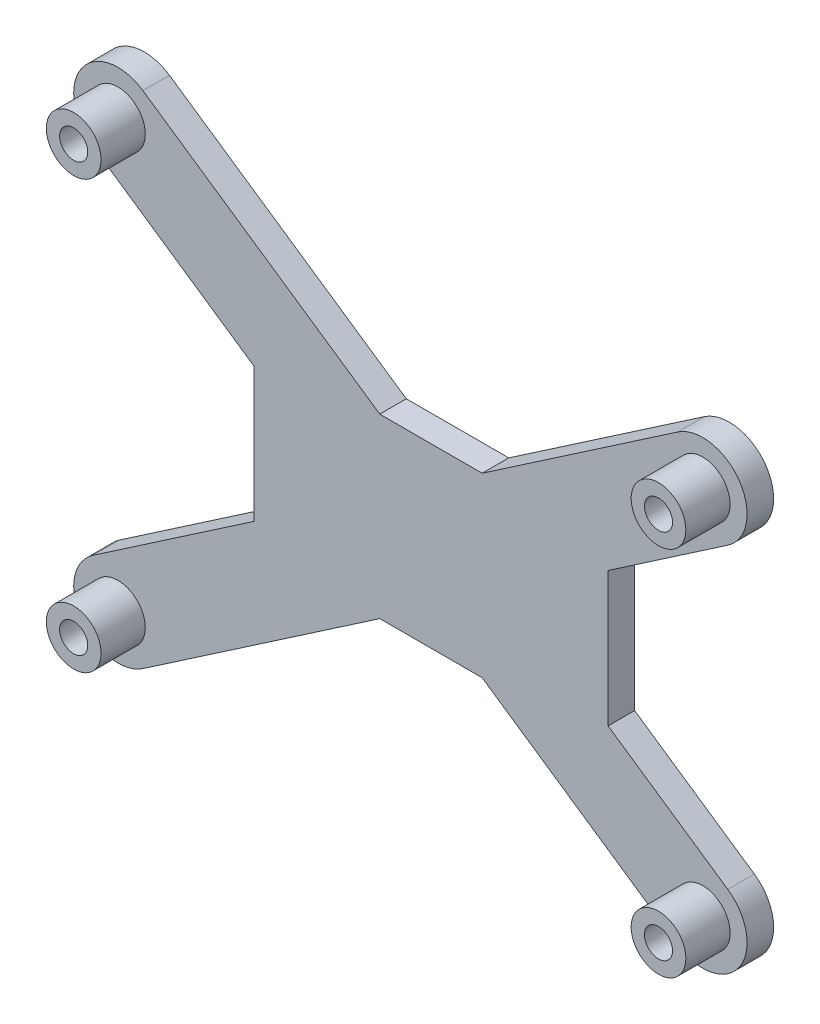
ISO-10303-21;
HEADER;
FILE_DESCRIPTION(('STEP AP214'),'2;1');
FILE_NAME('part.step','',(''),(''),'','','');
FILE_SCHEMA(('AUTOMOTIVE_DESIGN { 1 0 10303 214 1 1 1 1 }'));
ENDSEC;
DATA;
#1=APPLICATION_CONTEXT('core data for automotive mechanical design processes');
#2=APPLICATION_PROTOCOL_DEFINITION('international standard','automotive_design',2000,#1);
#3=PRODUCT_CONTEXT('',#1,'mechanical');
#4=PRODUCT('Part','Part','',(#3));
#5=PRODUCT_RELATED_PRODUCT_CATEGORY('part','',(#4));
#6=PRODUCT_DEFINITION_FORMATION('','',#4);
#7=PRODUCT_DEFINITION_CONTEXT('part definition',#1,'design');
#8=PRODUCT_DEFINITION('design','',#6,#7);
#9=PRODUCT_DEFINITION_SHAPE('','',#8);
#10=(LENGTH_UNIT() NAMED_UNIT(*) SI_UNIT(.MILLI.,.METRE.));
#11=(NAMED_UNIT(*) PLANE_ANGLE_UNIT() SI_UNIT($,.RADIAN.));
#12=(NAMED_UNIT(*) SI_UNIT($,.STERADIAN.) SOLID_ANGLE_UNIT());
#13=UNCERTAINTY_MEASURE_WITH_UNIT(LENGTH_MEASURE(1.E-05),#10,'distance_accuracy_value','');
#14=(GEOMETRIC_REPRESENTATION_CONTEXT(3) GLOBAL_UNCERTAINTY_ASSIGNED_CONTEXT((#13)) GLOBAL_UNIT_ASSIGNED_CONTEXT((#10,
#11,#12)) REPRESENTATION_CONTEXT('',''));
#15=CARTESIAN_POINT('',(0.,0.,0.));
#16=DIRECTION('',(0.,0.,1.));
#17=DIRECTION('',(1.,0.,0.));
#18=AXIS2_PLACEMENT_3D('',#15,#16,#17);
#19=CARTESIAN_POINT('',(14.605,51.435,0.));
#20=DIRECTION('',(0.,0.,1.));
#21=DIRECTION('',(1.,0.,0.));
#22=AXIS2_PLACEMENT_3D('',#19,#20,#21);
#23=PLANE('',#22);
#24=CARTESIAN_POINT('',(80.645,48.26,0.));
#25=DIRECTION('',(0.,0.,1.));
#26=DIRECTION('',(1.,0.,0.));
#27=AXIS2_PLACEMENT_3D('',#24,#25,#26);
#28=CIRCLE('',#27,3.08749999999998);
#29=CARTESIAN_POINT('',(83.7325,48.26,0.));
#30=VERTEX_POINT('',#29);
#31=EDGE_CURVE('E392',#30,#30,#28,.T.);
#32=ORIENTED_EDGE('',*,*,#31,.F.);
#33=EDGE_LOOP('',(#32));
#34=FACE_BOUND('',#33,.T.);
#35=CARTESIAN_POINT('',(14.605,3.175,0.));
#36=DIRECTION('',(0.,0.,1.));
#37=DIRECTION('',(1.,0.,0.));
#38=AXIS2_PLACEMENT_3D('',#35,#36,#37);
#39=CIRCLE('',#38,3.0875);
#40=CARTESIAN_POINT('',(17.6925,3.175,0.));
#41=VERTEX_POINT('',#40);
#42=EDGE_CURVE('E231',#41,#41,#39,.T.);
#43=ORIENTED_EDGE('',*,*,#42,.F.);
#44=EDGE_LOOP('',(#43));
#45=FACE_BOUND('',#44,.T.);
#46=CARTESIAN_POINT('',(14.605,51.435,0.));
#47=DIRECTION('',(0.,0.,1.));
#48=DIRECTION('',(1.,0.,0.));
#49=AXIS2_PLACEMENT_3D('',#46,#47,#48);
#50=CIRCLE('',#49,5.);
#51=CARTESIAN_POINT('',(17.4241477652776,55.5644558815334,0.));
#52=VERTEX_POINT('',#51);
#53=CARTESIAN_POINT('',(11.7858522347224,47.3055441184666,0.));
#54=VERTEX_POINT('',#53);
#55=EDGE_CURVE('E183',#52,#54,#50,.T.);
#56=ORIENTED_EDGE('',*,*,#55,.T.);
#57=DIRECTION('',(0.825891176306671,-0.563829553055516,0.));
#58=VECTOR('',#57,1.);
#59=CARTESIAN_POINT('',(11.7858522347224,47.3055441184666,0.));
#60=LINE('',#59,#58);
#61=CARTESIAN_POINT('',(29.9503521126761,34.9047797787098,0.));
#62=VERTEX_POINT('',#61);
#63=EDGE_CURVE('E186',#54,#62,#60,.T.);
#64=ORIENTED_EDGE('',*,*,#63,.T.);
#65=DIRECTION('',(0.,-1.,0.));
#66=VECTOR('',#65,1.);
#67=CARTESIAN_POINT('',(29.9503521126761,34.9047797787098,0.));
#68=LINE('',#67,#66);
#69=CARTESIAN_POINT('',(29.9503521126761,19.7052202212901,0.));
#70=VERTEX_POINT('',#69);
#71=EDGE_CURVE('E190',#62,#70,#68,.T.);
#72=ORIENTED_EDGE('',*,*,#71,.T.);
#73=DIRECTION('',(-0.825891176306672,-0.563829553055516,0.));
#74=VECTOR('',#73,1.);
#75=CARTESIAN_POINT('',(11.7858522347224,7.30445588153335,0.));
#76=LINE('',#75,#74);
#77=CARTESIAN_POINT('',(11.7858522347224,7.30445588153335,0.));
#78=VERTEX_POINT('',#77);
#79=EDGE_CURVE('E193',#70,#78,#76,.T.);
#80=ORIENTED_EDGE('',*,*,#79,.T.);
#81=CARTESIAN_POINT('',(14.605,3.175,0.));
#82=DIRECTION('',(0.,0.,1.));
#83=DIRECTION('',(1.,0.,0.));
#84=AXIS2_PLACEMENT_3D('',#81,#82,#83);
#85=CIRCLE('',#84,4.99999999999999);
#86=CARTESIAN_POINT('',(17.4241477652776,-0.954455881533353,0.));
#87=VERTEX_POINT('',#86);
#88=EDGE_CURVE('E196',#78,#87,#85,.T.);
#89=ORIENTED_EDGE('',*,*,#88,.T.);
#90=DIRECTION('',(0.825891176306671,0.563829553055516,0.));
#91=VECTOR('',#90,1.);
#92=CARTESIAN_POINT('',(17.4241477652776,-0.954455881533353,0.));
#93=LINE('',#92,#91);
#94=CARTESIAN_POINT('',(44.1703930001996,17.305,0.));
#95=VERTEX_POINT('',#94);
#96=EDGE_CURVE('E199',#87,#95,#93,.T.);
#97=ORIENTED_EDGE('',*,*,#96,.T.);
#98=DIRECTION('',(1.,0.,0.));
#99=VECTOR('',#98,1.);
#100=CARTESIAN_POINT('',(49.9503521126761,17.305,0.));
#101=LINE('',#100,#99);
#102=CARTESIAN_POINT('',(55.7303112251524,17.305,0.));
#103=VERTEX_POINT('',#102);
#104=EDGE_CURVE('E202',#95,#103,#101,.T.);
#105=ORIENTED_EDGE('',*,*,#104,.T.);
#106=DIRECTION('',(0.825891176306671,-0.563829553055516,0.));
#107=VECTOR('',#106,1.);
#108=CARTESIAN_POINT('',(55.7303112251524,17.305,0.));
#109=LINE('',#108,#107);
#110=CARTESIAN_POINT('',(77.8258522347224,2.22054411846664,0.));
#111=VERTEX_POINT('',#110);
#112=EDGE_CURVE('E205',#103,#111,#109,.T.);
#113=ORIENTED_EDGE('',*,*,#112,.T.);
#114=CARTESIAN_POINT('',(80.645,6.35,0.));
#115=DIRECTION('',(0.,0.,1.));
#116=DIRECTION('',(1.,0.,0.));
#117=AXIS2_PLACEMENT_3D('',#114,#115,#116);
#118=CIRCLE('',#117,5.00000000000001);
#119=CARTESIAN_POINT('',(83.4641477652776,10.4794558815334,0.));
#120=VERTEX_POINT('',#119);
#121=EDGE_CURVE('E208',#111,#120,#118,.T.);
#122=ORIENTED_EDGE('',*,*,#121,.T.);
#123=DIRECTION('',(-0.825891176306671,0.563829553055516,0.));
#124=VECTOR('',#123,1.);
#125=CARTESIAN_POINT('',(69.9503521126761,19.7052202212902,0.));
#126=LINE('',#125,#124);
#127=CARTESIAN_POINT('',(69.9503521126761,19.7052202212902,0.));
#128=VERTEX_POINT('',#127);
#129=EDGE_CURVE('E211',#120,#128,#126,.T.);
#130=ORIENTED_EDGE('',*,*,#129,.T.);
#131=DIRECTION('',(0.,1.,0.));
#132=VECTOR('',#131,1.);
#133=CARTESIAN_POINT('',(69.9503521126761,34.9047797787098,0.));
#134=LINE('',#133,#132);
#135=CARTESIAN_POINT('',(69.9503521126761,34.9047797787098,0.));
#136=VERTEX_POINT('',#135);
#137=EDGE_CURVE('E214',#128,#136,#134,.T.);
#138=ORIENTED_EDGE('',*,*,#137,.T.);
#139=DIRECTION('',(0.825891176306671,0.563829553055516,0.));
#140=VECTOR('',#139,1.);
#141=CARTESIAN_POINT('',(69.9503521126761,34.9047797787098,0.));
#142=LINE('',#141,#140);
#143=CARTESIAN_POINT('',(83.4641477652776,44.1305441184666,0.));
#144=VERTEX_POINT('',#143);
#145=EDGE_CURVE('E217',#136,#144,#142,.T.);
#146=ORIENTED_EDGE('',*,*,#145,.T.);
#147=CARTESIAN_POINT('',(80.645,48.26,0.));
#148=DIRECTION('',(0.,0.,1.));
#149=DIRECTION('',(1.,0.,0.));
#150=AXIS2_PLACEMENT_3D('',#147,#148,#149);
#151=CIRCLE('',#150,5.);
#152=CARTESIAN_POINT('',(77.8258522347224,52.3894558815334,0.));
#153=VERTEX_POINT('',#152);
#154=EDGE_CURVE('E220',#144,#153,#151,.T.);
#155=ORIENTED_EDGE('',*,*,#154,.T.);
#156=DIRECTION('',(-0.825891176306671,-0.563829553055516,0.));
#157=VECTOR('',#156,1.);
#158=CARTESIAN_POINT('',(55.7303112251524,37.305,0.));
#159=LINE('',#158,#157);
#160=CARTESIAN_POINT('',(55.7303112251524,37.305,0.));
#161=VERTEX_POINT('',#160);
#162=EDGE_CURVE('E223',#153,#161,#159,.T.);
#163=ORIENTED_EDGE('',*,*,#162,.T.);
#164=DIRECTION('',(-1.,0.,0.));
#165=VECTOR('',#164,1.);
#166=CARTESIAN_POINT('',(49.9503521126761,37.305,0.));
#167=LINE('',#166,#165);
#168=CARTESIAN_POINT('',(44.1703930001997,37.305,0.));
#169=VERTEX_POINT('',#168);
#170=EDGE_CURVE('E159',#161,#169,#167,.T.);
#171=ORIENTED_EDGE('',*,*,#170,.T.);
#172=DIRECTION('',(-0.825891176306671,0.563829553055516,0.));
#173=VECTOR('',#172,1.);
#174=CARTESIAN_POINT('',(17.4241477652776,55.5644558815334,0.));
#175=LINE('',#174,#173);
#176=EDGE_CURVE('E226',#169,#52,#175,.T.);
#177=ORIENTED_EDGE('',*,*,#176,.T.);
#178=EDGE_LOOP('',(#56,#64,#72,#80,#89,#97,#105,#113,#122,#130,#138,#146,#155,#163,#171,#177));
#179=FACE_BOUND('',#178,.T.);
#180=CARTESIAN_POINT('',(14.605,51.435,0.));
#181=DIRECTION('',(0.,0.,1.));
#182=DIRECTION('',(1.,0.,0.));
#183=AXIS2_PLACEMENT_3D('',#180,#181,#182);
#184=CIRCLE('',#183,3.0875);
#185=CARTESIAN_POINT('',(17.6925,51.435,0.));
#186=VERTEX_POINT('',#185);
#187=EDGE_CURVE('E401',#186,#186,#184,.T.);
#188=ORIENTED_EDGE('',*,*,#187,.F.);
#189=EDGE_LOOP('',(#188));
#190=FACE_BOUND('',#189,.T.);
#191=CARTESIAN_POINT('',(80.645,6.35,0.));
#192=DIRECTION('',(0.,0.,1.));
#193=DIRECTION('',(1.,0.,0.));
#194=AXIS2_PLACEMENT_3D('',#191,#192,#193);
#195=CIRCLE('',#194,3.08749999999999);
#196=CARTESIAN_POINT('',(83.7325,6.35,0.));
#197=VERTEX_POINT('',#196);
#198=EDGE_CURVE('E383',#197,#197,#195,.T.);
#199=ORIENTED_EDGE('',*,*,#198,.F.);
#200=EDGE_LOOP('',(#199));
#201=FACE_BOUND('',#200,.T.);
#202=ADVANCED_FACE('F35',(#34,#45,#179,#190,#201),#23,.T.);
#203=CARTESIAN_POINT('',(14.605,3.175,5.));
#204=DIRECTION('',(0.,0.,1.));
#205=DIRECTION('',(1.,0.,0.));
#206=AXIS2_PLACEMENT_3D('',#203,#204,#205);
#207=PLANE('',#206);
#208=CARTESIAN_POINT('',(14.605,3.175,5.));
#209=DIRECTION('',(0.,0.,1.));
#210=DIRECTION('',(1.,0.,0.));
#211=AXIS2_PLACEMENT_3D('',#208,#209,#210);
#212=CIRCLE('',#211,3.0875);
#213=CARTESIAN_POINT('',(17.6925,3.175,5.));
#214=VERTEX_POINT('',#213);
#215=EDGE_CURVE('E11',#214,#214,#212,.T.);
#216=ORIENTED_EDGE('',*,*,#215,.T.);
#217=EDGE_LOOP('',(#216));
#218=FACE_BOUND('',#217,.T.);
#219=CARTESIAN_POINT('',(14.605,3.175,5.));
#220=DIRECTION('',(0.,0.,1.));
#221=DIRECTION('',(1.,0.,0.));
#222=AXIS2_PLACEMENT_3D('',#219,#220,#221);
#223=CIRCLE('',#222,1.5875);
#224=CARTESIAN_POINT('',(16.1925,3.175,5.));
#225=VERTEX_POINT('',#224);
#226=EDGE_CURVE('E44',#225,#225,#223,.T.);
#227=ORIENTED_EDGE('',*,*,#226,.F.);
#228=EDGE_LOOP('',(#227));
#229=FACE_BOUND('',#228,.T.);
#230=ADVANCED_FACE('F265',(#218,#229),#207,.T.);
#231=CARTESIAN_POINT('',(14.605,3.175,5.));
#232=DIRECTION('',(0.,0.,-1.));
#233=DIRECTION('',(-1.,0.,0.));
#234=AXIS2_PLACEMENT_3D('',#231,#232,#233);
#235=CYLINDRICAL_SURFACE('',#234,3.0875);
#236=ORIENTED_EDGE('',*,*,#215,.F.);
#237=EDGE_LOOP('',(#236));
#238=FACE_BOUND('',#237,.T.);
#239=ORIENTED_EDGE('',*,*,#42,.T.);
#240=EDGE_LOOP('',(#239));
#241=FACE_BOUND('',#240,.T.);
#242=ADVANCED_FACE('F37',(#238,#241),#235,.T.);
#243=CARTESIAN_POINT('',(14.605,3.175,5.));
#244=DIRECTION('',(0.,0.,-1.));
#245=DIRECTION('',(-1.,0.,0.));
#246=AXIS2_PLACEMENT_3D('',#243,#244,#245);
#247=CYLINDRICAL_SURFACE('',#246,1.5875);
#248=ORIENTED_EDGE('',*,*,#226,.T.);
#249=EDGE_LOOP('',(#248));
#250=FACE_BOUND('',#249,.T.);
#251=CARTESIAN_POINT('',(14.605,3.175,-3.));
#252=DIRECTION('',(0.,0.,1.));
#253=DIRECTION('',(1.,0.,0.));
#254=AXIS2_PLACEMENT_3D('',#251,#252,#253);
#255=CIRCLE('',#254,1.5875);
#256=CARTESIAN_POINT('',(16.1925,3.175,-3.));
#257=VERTEX_POINT('',#256);
#258=EDGE_CURVE('E413',#257,#257,#255,.T.);
#259=ORIENTED_EDGE('',*,*,#258,.F.);
#260=EDGE_LOOP('',(#259));
#261=FACE_BOUND('',#260,.T.);
#262=ADVANCED_FACE('F262',(#250,#261),#247,.F.);
#263=CARTESIAN_POINT('',(14.605,51.435,-3.));
#264=DIRECTION('',(0.,0.,1.));
#265=DIRECTION('',(1.,0.,0.));
#266=AXIS2_PLACEMENT_3D('',#263,#264,#265);
#267=CYLINDRICAL_SURFACE('',#266,5.);
#268=ORIENTED_EDGE('',*,*,#55,.F.);
#269=DIRECTION('',(0.,0.,1.));
#270=VECTOR('',#269,1.);
#271=CARTESIAN_POINT('',(17.4241477652776,55.5644558815334,-3.));
#272=LINE('',#271,#270);
#273=CARTESIAN_POINT('',(17.4241477652776,55.5644558815334,-3.));
#274=VERTEX_POINT('',#273);
#275=EDGE_CURVE('E52',#274,#52,#272,.T.);
#276=ORIENTED_EDGE('',*,*,#275,.F.);
#277=CARTESIAN_POINT('',(14.605,51.435,-3.));
#278=DIRECTION('',(0.,0.,1.));
#279=DIRECTION('',(1.,0.,0.));
#280=AXIS2_PLACEMENT_3D('',#277,#278,#279);
#281=CIRCLE('',#280,5.);
#282=CARTESIAN_POINT('',(11.7858522347224,47.3055441184666,-3.));
#283=VERTEX_POINT('',#282);
#284=EDGE_CURVE('E229',#274,#283,#281,.T.);
#285=ORIENTED_EDGE('',*,*,#284,.T.);
#286=DIRECTION('',(0.,0.,1.));
#287=VECTOR('',#286,1.);
#288=CARTESIAN_POINT('',(11.7858522347224,47.3055441184666,-3.));
#289=LINE('',#288,#287);
#290=EDGE_CURVE('E116',#283,#54,#289,.T.);
#291=ORIENTED_EDGE('',*,*,#290,.T.);
#292=EDGE_LOOP('',(#268,#276,#285,#291));
#293=FACE_BOUND('',#292,.T.);
#294=ADVANCED_FACE('F278',(#293),#267,.T.);
#295=CARTESIAN_POINT('',(17.4241477652776,55.5644558815334,-3.));
#296=DIRECTION('',(0.563829553055516,0.825891176306671,0.));
#297=DIRECTION('',(-0.825891176306671,0.563829553055516,0.));
#298=AXIS2_PLACEMENT_3D('',#295,#296,#297);
#299=PLANE('',#298);
#300=ORIENTED_EDGE('',*,*,#176,.F.);
#301=DIRECTION('',(0.,0.,1.));
#302=VECTOR('',#301,1.);
#303=CARTESIAN_POINT('',(44.1703930001997,37.305,-3.));
#304=LINE('',#303,#302);
#305=CARTESIAN_POINT('',(44.1703930001997,37.305,-3.));
#306=VERTEX_POINT('',#305);
#307=EDGE_CURVE('E104',#306,#169,#304,.T.);
#308=ORIENTED_EDGE('',*,*,#307,.F.);
#309=DIRECTION('',(-0.825891176306671,0.563829553055516,0.));
#310=VECTOR('',#309,1.);
#311=CARTESIAN_POINT('',(17.4241477652776,55.5644558815334,-3.));
#312=LINE('',#311,#310);
#313=EDGE_CURVE('E173',#306,#274,#312,.T.);
#314=ORIENTED_EDGE('',*,*,#313,.T.);
#315=ORIENTED_EDGE('',*,*,#275,.T.);
#316=EDGE_LOOP('',(#300,#308,#314,#315));
#317=FACE_BOUND('',#316,.T.);
#318=ADVANCED_FACE('F281',(#317),#299,.T.);
#319=CARTESIAN_POINT('',(49.9503521126761,37.305,-3.));
#320=DIRECTION('',(0.,1.,0.));
#321=DIRECTION('',(0.,0.,1.));
#322=AXIS2_PLACEMENT_3D('',#319,#320,#321);
#323=PLANE('',#322);
#324=ORIENTED_EDGE('',*,*,#170,.F.);
#325=DIRECTION('',(0.,0.,1.));
#326=VECTOR('',#325,1.);
#327=CARTESIAN_POINT('',(55.7303112251524,37.305,-3.));
#328=LINE('',#327,#326);
#329=CARTESIAN_POINT('',(55.7303112251524,37.305,-3.));
#330=VERTEX_POINT('',#329);
#331=EDGE_CURVE('E155',#330,#161,#328,.T.);
#332=ORIENTED_EDGE('',*,*,#331,.F.);
#333=DIRECTION('',(-1.,0.,0.));
#334=VECTOR('',#333,1.);
#335=CARTESIAN_POINT('',(49.9503521126761,37.305,-3.));
#336=LINE('',#335,#334);
#337=EDGE_CURVE('E158',#330,#306,#336,.T.);
#338=ORIENTED_EDGE('',*,*,#337,.T.);
#339=ORIENTED_EDGE('',*,*,#307,.T.);
#340=EDGE_LOOP('',(#324,#332,#338,#339));
#341=FACE_BOUND('',#340,.T.);
#342=ADVANCED_FACE('F157',(#341),#323,.T.);
#343=CARTESIAN_POINT('',(55.7303112251524,37.305,-3.));
#344=DIRECTION('',(-0.563829553055516,0.825891176306671,0.));
#345=DIRECTION('',(-0.825891176306671,-0.563829553055516,0.));
#346=AXIS2_PLACEMENT_3D('',#343,#344,#345);
#347=PLANE('',#346);
#348=ORIENTED_EDGE('',*,*,#162,.F.);
#349=DIRECTION('',(0.,0.,1.));
#350=VECTOR('',#349,1.);
#351=CARTESIAN_POINT('',(77.8258522347224,52.3894558815334,-3.));
#352=LINE('',#351,#350);
#353=CARTESIAN_POINT('',(77.8258522347224,52.3894558815334,-3.));
#354=VERTEX_POINT('',#353);
#355=EDGE_CURVE('E164',#354,#153,#352,.T.);
#356=ORIENTED_EDGE('',*,*,#355,.F.);
#357=DIRECTION('',(-0.825891176306671,-0.563829553055516,0.));
#358=VECTOR('',#357,1.);
#359=CARTESIAN_POINT('',(55.7303112251524,37.305,-3.));
#360=LINE('',#359,#358);
#361=EDGE_CURVE('E171',#354,#330,#360,.T.);
#362=ORIENTED_EDGE('',*,*,#361,.T.);
#363=ORIENTED_EDGE('',*,*,#331,.T.);
#364=EDGE_LOOP('',(#348,#356,#362,#363));
#365=FACE_BOUND('',#364,.T.);
#366=ADVANCED_FACE('F175',(#365),#347,.T.);
#367=CARTESIAN_POINT('',(80.645,48.26,-3.));
#368=DIRECTION('',(0.,0.,1.));
#369=DIRECTION('',(1.,0.,0.));
#370=AXIS2_PLACEMENT_3D('',#367,#368,#369);
#371=CYLINDRICAL_SURFACE('',#370,5.);
#372=ORIENTED_EDGE('',*,*,#154,.F.);
#373=DIRECTION('',(0.,0.,1.));
#374=VECTOR('',#373,1.);
#375=CARTESIAN_POINT('',(83.4641477652776,44.1305441184666,-3.));
#376=LINE('',#375,#374);
#377=CARTESIAN_POINT('',(83.4641477652776,44.1305441184666,-3.));
#378=VERTEX_POINT('',#377);
#379=EDGE_CURVE('E234',#378,#144,#376,.T.);
#380=ORIENTED_EDGE('',*,*,#379,.F.);
#381=CARTESIAN_POINT('',(80.645,48.26,-3.));
#382=DIRECTION('',(0.,0.,1.));
#383=DIRECTION('',(1.,0.,0.));
#384=AXIS2_PLACEMENT_3D('',#381,#382,#383);
#385=CIRCLE('',#384,5.);
#386=EDGE_CURVE('E176',#378,#354,#385,.T.);
#387=ORIENTED_EDGE('',*,*,#386,.T.);
#388=ORIENTED_EDGE('',*,*,#355,.T.);
#389=EDGE_LOOP('',(#372,#380,#387,#388));
#390=FACE_BOUND('',#389,.T.);
#391=ADVANCED_FACE('F324',(#390),#371,.T.);
#392=CARTESIAN_POINT('',(69.9503521126761,34.9047797787098,-3.));
#393=DIRECTION('',(0.563829553055516,-0.825891176306671,0.));
#394=DIRECTION('',(0.825891176306671,0.563829553055516,0.));
#395=AXIS2_PLACEMENT_3D('',#392,#393,#394);
#396=PLANE('',#395);
#397=ORIENTED_EDGE('',*,*,#145,.F.);
#398=DIRECTION('',(0.,0.,1.));
#399=VECTOR('',#398,1.);
#400=CARTESIAN_POINT('',(69.9503521126761,34.9047797787098,-3.));
#401=LINE('',#400,#399);
#402=CARTESIAN_POINT('',(69.9503521126761,34.9047797787098,-3.));
#403=VERTEX_POINT('',#402);
#404=EDGE_CURVE('E236',#403,#136,#401,.T.);
#405=ORIENTED_EDGE('',*,*,#404,.F.);
#406=DIRECTION('',(0.825891176306671,0.563829553055516,0.));
#407=VECTOR('',#406,1.);
#408=CARTESIAN_POINT('',(69.9503521126761,34.9047797787098,-3.));
#409=LINE('',#408,#407);
#410=EDGE_CURVE('E178',#403,#378,#409,.T.);
#411=ORIENTED_EDGE('',*,*,#410,.T.);
#412=ORIENTED_EDGE('',*,*,#379,.T.);
#413=EDGE_LOOP('',(#397,#405,#411,#412));
#414=FACE_BOUND('',#413,.T.);
#415=ADVANCED_FACE('F320',(#414),#396,.T.);
#416=CARTESIAN_POINT('',(69.9503521126761,34.9047797787098,-3.));
#417=DIRECTION('',(1.,0.,0.));
#418=DIRECTION('',(0.,0.,-1.));
#419=AXIS2_PLACEMENT_3D('',#416,#417,#418);
#420=PLANE('',#419);
#421=ORIENTED_EDGE('',*,*,#137,.F.);
#422=DIRECTION('',(0.,0.,1.));
#423=VECTOR('',#422,1.);
#424=CARTESIAN_POINT('',(69.9503521126761,19.7052202212902,-3.));
#425=LINE('',#424,#423);
#426=CARTESIAN_POINT('',(69.9503521126761,19.7052202212902,-3.));
#427=VERTEX_POINT('',#426);
#428=EDGE_CURVE('E238',#427,#128,#425,.T.);
#429=ORIENTED_EDGE('',*,*,#428,.F.);
#430=DIRECTION('',(0.,1.,0.));
#431=VECTOR('',#430,1.);
#432=CARTESIAN_POINT('',(69.9503521126761,34.9047797787098,-3.));
#433=LINE('',#432,#431);
#434=EDGE_CURVE('E444',#427,#403,#433,.T.);
#435=ORIENTED_EDGE('',*,*,#434,.T.);
#436=ORIENTED_EDGE('',*,*,#404,.T.);
#437=EDGE_LOOP('',(#421,#429,#435,#436));
#438=FACE_BOUND('',#437,.T.);
#439=ADVANCED_FACE('F316',(#438),#420,.T.);
#440=CARTESIAN_POINT('',(69.9503521126761,19.7052202212902,-3.));
#441=DIRECTION('',(0.563829553055516,0.825891176306671,0.));
#442=DIRECTION('',(-0.825891176306671,0.563829553055516,0.));
#443=AXIS2_PLACEMENT_3D('',#440,#441,#442);
#444=PLANE('',#443);
#445=ORIENTED_EDGE('',*,*,#129,.F.);
#446=DIRECTION('',(0.,0.,1.));
#447=VECTOR('',#446,1.);
#448=CARTESIAN_POINT('',(83.4641477652776,10.4794558815334,-3.));
#449=LINE('',#448,#447);
#450=CARTESIAN_POINT('',(83.4641477652776,10.4794558815334,-3.));
#451=VERTEX_POINT('',#450);
#452=EDGE_CURVE('E240',#451,#120,#449,.T.);
#453=ORIENTED_EDGE('',*,*,#452,.F.);
#454=DIRECTION('',(-0.825891176306671,0.563829553055516,0.));
#455=VECTOR('',#454,1.);
#456=CARTESIAN_POINT('',(69.9503521126761,19.7052202212902,-3.));
#457=LINE('',#456,#455);
#458=EDGE_CURVE('E441',#451,#427,#457,.T.);
#459=ORIENTED_EDGE('',*,*,#458,.T.);
#460=ORIENTED_EDGE('',*,*,#428,.T.);
#461=EDGE_LOOP('',(#445,#453,#459,#460));
#462=FACE_BOUND('',#461,.T.);
#463=ADVANCED_FACE('F312',(#462),#444,.T.);
#464=CARTESIAN_POINT('',(80.645,6.35,-3.));
#465=DIRECTION('',(0.,0.,1.));
#466=DIRECTION('',(1.,0.,0.));
#467=AXIS2_PLACEMENT_3D('',#464,#465,#466);
#468=CYLINDRICAL_SURFACE('',#467,5.00000000000001);
#469=ORIENTED_EDGE('',*,*,#121,.F.);
#470=DIRECTION('',(0.,0.,1.));
#471=VECTOR('',#470,1.);
#472=CARTESIAN_POINT('',(77.8258522347224,2.22054411846664,-3.));
#473=LINE('',#472,#471);
#474=CARTESIAN_POINT('',(77.8258522347224,2.22054411846664,-3.));
#475=VERTEX_POINT('',#474);
#476=EDGE_CURVE('E242',#475,#111,#473,.T.);
#477=ORIENTED_EDGE('',*,*,#476,.F.);
#478=CARTESIAN_POINT('',(80.645,6.35,-3.));
#479=DIRECTION('',(0.,0.,1.));
#480=DIRECTION('',(1.,0.,0.));
#481=AXIS2_PLACEMENT_3D('',#478,#479,#480);
#482=CIRCLE('',#481,5.00000000000001);
#483=EDGE_CURVE('E438',#475,#451,#482,.T.);
#484=ORIENTED_EDGE('',*,*,#483,.T.);
#485=ORIENTED_EDGE('',*,*,#452,.T.);
#486=EDGE_LOOP('',(#469,#477,#484,#485));
#487=FACE_BOUND('',#486,.T.);
#488=ADVANCED_FACE('F308',(#487),#468,.T.);
#489=CARTESIAN_POINT('',(55.7303112251524,17.305,-3.));
#490=DIRECTION('',(-0.563829553055516,-0.825891176306671,0.));
#491=DIRECTION('',(0.825891176306671,-0.563829553055516,0.));
#492=AXIS2_PLACEMENT_3D('',#489,#490,#491);
#493=PLANE('',#492);
#494=ORIENTED_EDGE('',*,*,#112,.F.);
#495=DIRECTION('',(0.,0.,1.));
#496=VECTOR('',#495,1.);
#497=CARTESIAN_POINT('',(55.7303112251524,17.305,-3.));
#498=LINE('',#497,#496);
#499=CARTESIAN_POINT('',(55.7303112251524,17.305,-3.));
#500=VERTEX_POINT('',#499);
#501=EDGE_CURVE('E244',#500,#103,#498,.T.);
#502=ORIENTED_EDGE('',*,*,#501,.F.);
#503=DIRECTION('',(0.825891176306671,-0.563829553055516,0.));
#504=VECTOR('',#503,1.);
#505=CARTESIAN_POINT('',(55.7303112251524,17.305,-3.));
#506=LINE('',#505,#504);
#507=EDGE_CURVE('E435',#500,#475,#506,.T.);
#508=ORIENTED_EDGE('',*,*,#507,.T.);
#509=ORIENTED_EDGE('',*,*,#476,.T.);
#510=EDGE_LOOP('',(#494,#502,#508,#509));
#511=FACE_BOUND('',#510,.T.);
#512=ADVANCED_FACE('F304',(#511),#493,.T.);
#513=CARTESIAN_POINT('',(49.9503521126761,17.305,-3.));
#514=DIRECTION('',(0.,-1.,0.));
#515=DIRECTION('',(1.,0.,0.));
#516=AXIS2_PLACEMENT_3D('',#513,#514,#515);
#517=PLANE('',#516);
#518=ORIENTED_EDGE('',*,*,#104,.F.);
#519=DIRECTION('',(0.,0.,1.));
#520=VECTOR('',#519,1.);
#521=CARTESIAN_POINT('',(44.1703930001996,17.305,-3.));
#522=LINE('',#521,#520);
#523=CARTESIAN_POINT('',(44.1703930001996,17.305,-3.));
#524=VERTEX_POINT('',#523);
#525=EDGE_CURVE('E246',#524,#95,#522,.T.);
#526=ORIENTED_EDGE('',*,*,#525,.F.);
#527=DIRECTION('',(1.,0.,0.));
#528=VECTOR('',#527,1.);
#529=CARTESIAN_POINT('',(49.9503521126761,17.305,-3.));
#530=LINE('',#529,#528);
#531=EDGE_CURVE('E433',#524,#500,#530,.T.);
#532=ORIENTED_EDGE('',*,*,#531,.T.);
#533=ORIENTED_EDGE('',*,*,#501,.T.);
#534=EDGE_LOOP('',(#518,#526,#532,#533));
#535=FACE_BOUND('',#534,.T.);
#536=ADVANCED_FACE('F300',(#535),#517,.T.);
#537=CARTESIAN_POINT('',(17.4241477652776,-0.954455881533353,-3.));
#538=DIRECTION('',(0.563829553055516,-0.825891176306671,0.));
#539=DIRECTION('',(0.825891176306671,0.563829553055516,0.));
#540=AXIS2_PLACEMENT_3D('',#537,#538,#539);
#541=PLANE('',#540);
#542=ORIENTED_EDGE('',*,*,#96,.F.);
#543=DIRECTION('',(0.,0.,1.));
#544=VECTOR('',#543,1.);
#545=CARTESIAN_POINT('',(17.4241477652776,-0.954455881533353,-3.));
#546=LINE('',#545,#544);
#547=CARTESIAN_POINT('',(17.4241477652776,-0.954455881533353,-3.));
#548=VERTEX_POINT('',#547);
#549=EDGE_CURVE('E249',#548,#87,#546,.T.);
#550=ORIENTED_EDGE('',*,*,#549,.F.);
#551=DIRECTION('',(0.825891176306671,0.563829553055516,0.));
#552=VECTOR('',#551,1.);
#553=CARTESIAN_POINT('',(17.4241477652776,-0.954455881533353,-3.));
#554=LINE('',#553,#552);
#555=EDGE_CURVE('E430',#548,#524,#554,.T.);
#556=ORIENTED_EDGE('',*,*,#555,.T.);
#557=ORIENTED_EDGE('',*,*,#525,.T.);
#558=EDGE_LOOP('',(#542,#550,#556,#557));
#559=FACE_BOUND('',#558,.T.);
#560=ADVANCED_FACE('F296',(#559),#541,.T.);
#561=CARTESIAN_POINT('',(14.605,3.175,-3.));
#562=DIRECTION('',(0.,0.,1.));
#563=DIRECTION('',(1.,0.,0.));
#564=AXIS2_PLACEMENT_3D('',#561,#562,#563);
#565=CYLINDRICAL_SURFACE('',#564,4.99999999999999);
#566=ORIENTED_EDGE('',*,*,#88,.F.);
#567=DIRECTION('',(0.,0.,1.));
#568=VECTOR('',#567,1.);
#569=CARTESIAN_POINT('',(11.7858522347224,7.30445588153335,-3.));
#570=LINE('',#569,#568);
#571=CARTESIAN_POINT('',(11.7858522347224,7.30445588153335,-3.));
#572=VERTEX_POINT('',#571);
#573=EDGE_CURVE('E251',#572,#78,#570,.T.);
#574=ORIENTED_EDGE('',*,*,#573,.F.);
#575=CARTESIAN_POINT('',(14.605,3.175,-3.));
#576=DIRECTION('',(0.,0.,1.));
#577=DIRECTION('',(1.,0.,0.));
#578=AXIS2_PLACEMENT_3D('',#575,#576,#577);
#579=CIRCLE('',#578,4.99999999999999);
#580=EDGE_CURVE('E427',#572,#548,#579,.T.);
#581=ORIENTED_EDGE('',*,*,#580,.T.);
#582=ORIENTED_EDGE('',*,*,#549,.T.);
#583=EDGE_LOOP('',(#566,#574,#581,#582));
#584=FACE_BOUND('',#583,.T.);
#585=ADVANCED_FACE('F292',(#584),#565,.T.);
#586=CARTESIAN_POINT('',(11.7858522347224,7.30445588153335,-3.));
#587=DIRECTION('',(-0.563829553055516,0.825891176306671,0.));
#588=DIRECTION('',(-0.825891176306671,-0.563829553055516,0.));
#589=AXIS2_PLACEMENT_3D('',#586,#587,#588);
#590=PLANE('',#589);
#591=ORIENTED_EDGE('',*,*,#79,.F.);
#592=DIRECTION('',(0.,0.,1.));
#593=VECTOR('',#592,1.);
#594=CARTESIAN_POINT('',(29.9503521126761,19.7052202212901,-3.));
#595=LINE('',#594,#593);
#596=CARTESIAN_POINT('',(29.9503521126761,19.7052202212901,-3.));
#597=VERTEX_POINT('',#596);
#598=EDGE_CURVE('E253',#597,#70,#595,.T.);
#599=ORIENTED_EDGE('',*,*,#598,.F.);
#600=DIRECTION('',(-0.825891176306672,-0.563829553055516,0.));
#601=VECTOR('',#600,1.);
#602=CARTESIAN_POINT('',(11.7858522347224,7.30445588153335,-3.));
#603=LINE('',#602,#601);
#604=EDGE_CURVE('E424',#597,#572,#603,.T.);
#605=ORIENTED_EDGE('',*,*,#604,.T.);
#606=ORIENTED_EDGE('',*,*,#573,.T.);
#607=EDGE_LOOP('',(#591,#599,#605,#606));
#608=FACE_BOUND('',#607,.T.);
#609=ADVANCED_FACE('F288',(#608),#590,.T.);
#610=CARTESIAN_POINT('',(29.9503521126761,34.9047797787098,-3.));
#611=DIRECTION('',(-1.,0.,0.));
#612=DIRECTION('',(0.,-1.,0.));
#613=AXIS2_PLACEMENT_3D('',#610,#611,#612);
#614=PLANE('',#613);
#615=ORIENTED_EDGE('',*,*,#71,.F.);
#616=DIRECTION('',(0.,0.,1.));
#617=VECTOR('',#616,1.);
#618=CARTESIAN_POINT('',(29.9503521126761,34.9047797787098,-3.));
#619=LINE('',#618,#617);
#620=CARTESIAN_POINT('',(29.9503521126761,34.9047797787098,-3.));
#621=VERTEX_POINT('',#620);
#622=EDGE_CURVE('E255',#621,#62,#619,.T.);
#623=ORIENTED_EDGE('',*,*,#622,.F.);
#624=DIRECTION('',(0.,-1.,0.));
#625=VECTOR('',#624,1.);
#626=CARTESIAN_POINT('',(29.9503521126761,34.9047797787098,-3.));
#627=LINE('',#626,#625);
#628=EDGE_CURVE('E421',#621,#597,#627,.T.);
#629=ORIENTED_EDGE('',*,*,#628,.T.);
#630=ORIENTED_EDGE('',*,*,#598,.T.);
#631=EDGE_LOOP('',(#615,#623,#629,#630));
#632=FACE_BOUND('',#631,.T.);
#633=ADVANCED_FACE('F285',(#632),#614,.T.);
#634=CARTESIAN_POINT('',(11.7858522347224,47.3055441184666,-3.));
#635=DIRECTION('',(-0.563829553055516,-0.825891176306671,0.));
#636=DIRECTION('',(0.825891176306671,-0.563829553055516,0.));
#637=AXIS2_PLACEMENT_3D('',#634,#635,#636);
#638=PLANE('',#637);
#639=ORIENTED_EDGE('',*,*,#63,.F.);
#640=ORIENTED_EDGE('',*,*,#290,.F.);
#641=DIRECTION('',(0.825891176306671,-0.563829553055516,0.));
#642=VECTOR('',#641,1.);
#643=CARTESIAN_POINT('',(11.7858522347224,47.3055441184666,-3.));
#644=LINE('',#643,#642);
#645=EDGE_CURVE('E419',#283,#621,#644,.T.);
#646=ORIENTED_EDGE('',*,*,#645,.T.);
#647=ORIENTED_EDGE('',*,*,#622,.T.);
#648=EDGE_LOOP('',(#639,#640,#646,#647));
#649=FACE_BOUND('',#648,.T.);
#650=ADVANCED_FACE('F282',(#649),#638,.T.);
#651=CARTESIAN_POINT('',(14.605,51.435,-3.));
#652=DIRECTION('',(0.,0.,1.));
#653=DIRECTION('',(1.,0.,0.));
#654=AXIS2_PLACEMENT_3D('',#651,#652,#653);
#655=PLANE('',#654);
#656=CARTESIAN_POINT('',(80.645,48.26,-3.));
#657=DIRECTION('',(0.,0.,1.));
#658=DIRECTION('',(1.,0.,0.));
#659=AXIS2_PLACEMENT_3D('',#656,#657,#658);
#660=CIRCLE('',#659,1.58749999999999);
#661=CARTESIAN_POINT('',(82.2325,48.26,-3.));
#662=VERTEX_POINT('',#661);
#663=EDGE_CURVE('E405',#662,#662,#660,.T.);
#664=ORIENTED_EDGE('',*,*,#663,.T.);
#665=EDGE_LOOP('',(#664));
#666=FACE_BOUND('',#665,.T.);
#667=CARTESIAN_POINT('',(80.645,6.35,-3.));
#668=DIRECTION('',(0.,0.,1.));
#669=DIRECTION('',(1.,0.,0.));
#670=AXIS2_PLACEMENT_3D('',#667,#668,#669);
#671=CIRCLE('',#670,1.5875);
#672=CARTESIAN_POINT('',(82.2325,6.35,-3.));
#673=VERTEX_POINT('',#672);
#674=EDGE_CURVE('E410',#673,#673,#671,.T.);
#675=ORIENTED_EDGE('',*,*,#674,.T.);
#676=EDGE_LOOP('',(#675));
#677=FACE_BOUND('',#676,.T.);
#678=ORIENTED_EDGE('',*,*,#258,.T.);
#679=EDGE_LOOP('',(#678));
#680=FACE_BOUND('',#679,.T.);
#681=CARTESIAN_POINT('',(14.605,51.435,-3.));
#682=DIRECTION('',(0.,0.,1.));
#683=DIRECTION('',(1.,0.,0.));
#684=AXIS2_PLACEMENT_3D('',#681,#682,#683);
#685=CIRCLE('',#684,1.5875);
#686=CARTESIAN_POINT('',(16.1925,51.435,-3.));
#687=VERTEX_POINT('',#686);
#688=EDGE_CURVE('E187',#687,#687,#685,.T.);
#689=ORIENTED_EDGE('',*,*,#688,.T.);
#690=EDGE_LOOP('',(#689));
#691=FACE_BOUND('',#690,.T.);
#692=ORIENTED_EDGE('',*,*,#284,.F.);
#693=ORIENTED_EDGE('',*,*,#313,.F.);
#694=ORIENTED_EDGE('',*,*,#337,.F.);
#695=ORIENTED_EDGE('',*,*,#361,.F.);
#696=ORIENTED_EDGE('',*,*,#386,.F.);
#697=ORIENTED_EDGE('',*,*,#410,.F.);
#698=ORIENTED_EDGE('',*,*,#434,.F.);
#699=ORIENTED_EDGE('',*,*,#458,.F.);
#700=ORIENTED_EDGE('',*,*,#483,.F.);
#701=ORIENTED_EDGE('',*,*,#507,.F.);
#702=ORIENTED_EDGE('',*,*,#531,.F.);
#703=ORIENTED_EDGE('',*,*,#555,.F.);
#704=ORIENTED_EDGE('',*,*,#580,.F.);
#705=ORIENTED_EDGE('',*,*,#604,.F.);
#706=ORIENTED_EDGE('',*,*,#628,.F.);
#707=ORIENTED_EDGE('',*,*,#645,.F.);
#708=EDGE_LOOP('',(#692,#693,#694,#695,#696,#697,#698,#699,#700,#701,#702,#703,#704,#705,#706,#707));
#709=FACE_BOUND('',#708,.T.);
#710=ADVANCED_FACE('F169',(#666,#677,#680,#691,#709),#655,.F.);
#711=CARTESIAN_POINT('',(14.605,51.435,-3.));
#712=DIRECTION('',(0.,0.,1.));
#713=DIRECTION('',(1.,0.,0.));
#714=AXIS2_PLACEMENT_3D('',#711,#712,#713);
#715=CYLINDRICAL_SURFACE('',#714,1.5875);
#716=ORIENTED_EDGE('',*,*,#688,.F.);
#717=EDGE_LOOP('',(#716));
#718=FACE_BOUND('',#717,.T.);
#719=CARTESIAN_POINT('',(14.605,51.435,5.));
#720=DIRECTION('',(0.,0.,1.));
#721=DIRECTION('',(1.,0.,0.));
#722=AXIS2_PLACEMENT_3D('',#719,#720,#721);
#723=CIRCLE('',#722,1.5875);
#724=CARTESIAN_POINT('',(16.1925,51.435,5.));
#725=VERTEX_POINT('',#724);
#726=EDGE_CURVE('E396',#725,#725,#723,.T.);
#727=ORIENTED_EDGE('',*,*,#726,.T.);
#728=EDGE_LOOP('',(#727));
#729=FACE_BOUND('',#728,.T.);
#730=ADVANCED_FACE('F337',(#718,#729),#715,.F.);
#731=CARTESIAN_POINT('',(80.645,6.35,-3.));
#732=DIRECTION('',(0.,0.,1.));
#733=DIRECTION('',(1.,0.,0.));
#734=AXIS2_PLACEMENT_3D('',#731,#732,#733);
#735=CYLINDRICAL_SURFACE('',#734,1.5875);
#736=ORIENTED_EDGE('',*,*,#674,.F.);
#737=EDGE_LOOP('',(#736));
#738=FACE_BOUND('',#737,.T.);
#739=CARTESIAN_POINT('',(80.645,6.35,5.));
#740=DIRECTION('',(0.,0.,1.));
#741=DIRECTION('',(1.,0.,0.));
#742=AXIS2_PLACEMENT_3D('',#739,#740,#741);
#743=CIRCLE('',#742,1.5875);
#744=CARTESIAN_POINT('',(82.2325,6.35,5.));
#745=VERTEX_POINT('',#744);
#746=EDGE_CURVE('E381',#745,#745,#743,.T.);
#747=ORIENTED_EDGE('',*,*,#746,.T.);
#748=EDGE_LOOP('',(#747));
#749=FACE_BOUND('',#748,.T.);
#750=ADVANCED_FACE('F341',(#738,#749),#735,.F.);
#751=CARTESIAN_POINT('',(80.645,48.26,-3.));
#752=DIRECTION('',(0.,0.,1.));
#753=DIRECTION('',(1.,0.,0.));
#754=AXIS2_PLACEMENT_3D('',#751,#752,#753);
#755=CYLINDRICAL_SURFACE('',#754,1.58749999999999);
#756=ORIENTED_EDGE('',*,*,#663,.F.);
#757=EDGE_LOOP('',(#756));
#758=FACE_BOUND('',#757,.T.);
#759=CARTESIAN_POINT('',(80.645,48.26,5.));
#760=DIRECTION('',(0.,0.,1.));
#761=DIRECTION('',(1.,0.,0.));
#762=AXIS2_PLACEMENT_3D('',#759,#760,#761);
#763=CIRCLE('',#762,1.58749999999999);
#764=CARTESIAN_POINT('',(82.2325,48.26,5.));
#765=VERTEX_POINT('',#764);
#766=EDGE_CURVE('E388',#765,#765,#763,.T.);
#767=ORIENTED_EDGE('',*,*,#766,.T.);
#768=EDGE_LOOP('',(#767));
#769=FACE_BOUND('',#768,.T.);
#770=ADVANCED_FACE('F345',(#758,#769),#755,.F.);
#771=CARTESIAN_POINT('',(14.605,51.435,5.));
#772=DIRECTION('',(0.,0.,1.));
#773=DIRECTION('',(1.,0.,0.));
#774=AXIS2_PLACEMENT_3D('',#771,#772,#773);
#775=PLANE('',#774);
#776=CARTESIAN_POINT('',(14.605,51.435,5.));
#777=DIRECTION('',(0.,0.,1.));
#778=DIRECTION('',(1.,0.,0.));
#779=AXIS2_PLACEMENT_3D('',#776,#777,#778);
#780=CIRCLE('',#779,3.0875);
#781=CARTESIAN_POINT('',(17.6925,51.435,5.));
#782=VERTEX_POINT('',#781);
#783=EDGE_CURVE('E402',#782,#782,#780,.T.);
#784=ORIENTED_EDGE('',*,*,#783,.T.);
#785=EDGE_LOOP('',(#784));
#786=FACE_BOUND('',#785,.T.);
#787=ORIENTED_EDGE('',*,*,#726,.F.);
#788=EDGE_LOOP('',(#787));
#789=FACE_BOUND('',#788,.T.);
#790=ADVANCED_FACE('F349',(#786,#789),#775,.T.);
#791=CARTESIAN_POINT('',(14.605,51.435,5.));
#792=DIRECTION('',(0.,0.,-1.));
#793=DIRECTION('',(-1.,0.,0.));
#794=AXIS2_PLACEMENT_3D('',#791,#792,#793);
#795=CYLINDRICAL_SURFACE('',#794,3.0875);
#796=ORIENTED_EDGE('',*,*,#783,.F.);
#797=EDGE_LOOP('',(#796));
#798=FACE_BOUND('',#797,.T.);
#799=ORIENTED_EDGE('',*,*,#187,.T.);
#800=EDGE_LOOP('',(#799));
#801=FACE_BOUND('',#800,.T.);
#802=ADVANCED_FACE('F351',(#798,#801),#795,.T.);
#803=CARTESIAN_POINT('',(80.645,48.26,5.));
#804=DIRECTION('',(0.,0.,1.));
#805=DIRECTION('',(1.,0.,0.));
#806=AXIS2_PLACEMENT_3D('',#803,#804,#805);
#807=PLANE('',#806);
#808=CARTESIAN_POINT('',(80.645,48.26,5.));
#809=DIRECTION('',(0.,0.,1.));
#810=DIRECTION('',(1.,0.,0.));
#811=AXIS2_PLACEMENT_3D('',#808,#809,#810);
#812=CIRCLE('',#811,3.08749999999998);
#813=CARTESIAN_POINT('',(83.7325,48.26,5.));
#814=VERTEX_POINT('',#813);
#815=EDGE_CURVE('E393',#814,#814,#812,.T.);
#816=ORIENTED_EDGE('',*,*,#815,.T.);
#817=EDGE_LOOP('',(#816));
#818=FACE_BOUND('',#817,.T.);
#819=ORIENTED_EDGE('',*,*,#766,.F.);
#820=EDGE_LOOP('',(#819));
#821=FACE_BOUND('',#820,.T.);
#822=ADVANCED_FACE('F354',(#818,#821),#807,.T.);
#823=CARTESIAN_POINT('',(80.645,48.26,5.));
#824=DIRECTION('',(0.,0.,-1.));
#825=DIRECTION('',(-1.,0.,0.));
#826=AXIS2_PLACEMENT_3D('',#823,#824,#825);
#827=CYLINDRICAL_SURFACE('',#826,3.08749999999998);
#828=ORIENTED_EDGE('',*,*,#815,.F.);
#829=EDGE_LOOP('',(#828));
#830=FACE_BOUND('',#829,.T.);
#831=ORIENTED_EDGE('',*,*,#31,.T.);
#832=EDGE_LOOP('',(#831));
#833=FACE_BOUND('',#832,.T.);
#834=ADVANCED_FACE('F359',(#830,#833),#827,.T.);
#835=CARTESIAN_POINT('',(80.645,6.35,5.));
#836=DIRECTION('',(0.,0.,1.));
#837=DIRECTION('',(1.,0.,0.));
#838=AXIS2_PLACEMENT_3D('',#835,#836,#837);
#839=PLANE('',#838);
#840=CARTESIAN_POINT('',(80.645,6.35,5.));
#841=DIRECTION('',(0.,0.,1.));
#842=DIRECTION('',(1.,0.,0.));
#843=AXIS2_PLACEMENT_3D('',#840,#841,#842);
#844=CIRCLE('',#843,3.08749999999999);
#845=CARTESIAN_POINT('',(83.7325,6.35,5.));
#846=VERTEX_POINT('',#845);
#847=EDGE_CURVE('E378',#846,#846,#844,.T.);
#848=ORIENTED_EDGE('',*,*,#847,.T.);
#849=EDGE_LOOP('',(#848));
#850=FACE_BOUND('',#849,.T.);
#851=ORIENTED_EDGE('',*,*,#746,.F.);
#852=EDGE_LOOP('',(#851));
#853=FACE_BOUND('',#852,.T.);
#854=ADVANCED_FACE('F362',(#850,#853),#839,.T.);
#855=CARTESIAN_POINT('',(80.645,6.35,5.));
#856=DIRECTION('',(0.,0.,-1.));
#857=DIRECTION('',(-1.,0.,0.));
#858=AXIS2_PLACEMENT_3D('',#855,#856,#857);
#859=CYLINDRICAL_SURFACE('',#858,3.08749999999999);
#860=ORIENTED_EDGE('',*,*,#847,.F.);
#861=EDGE_LOOP('',(#860));
#862=FACE_BOUND('',#861,.T.);
#863=ORIENTED_EDGE('',*,*,#198,.T.);
#864=EDGE_LOOP('',(#863));
#865=FACE_BOUND('',#864,.T.);
#866=ADVANCED_FACE('F367',(#862,#865),#859,.T.);
#867=CLOSED_SHELL('',(#202,#230,#242,#262,#294,#318,#342,#366,#391,#415,#439,#463,#488,#512,
#536,#560,#585,#609,#633,#650,#710,#730,#750,#770,#790,#802,#822,#834,#854,#866));
#868=MANIFOLD_SOLID_BREP('B2',#867);
#869=ADVANCED_BREP_SHAPE_REPRESENTATION('',(#18,#868),#14);
#870=SHAPE_DEFINITION_REPRESENTATION(#9,#869);
ENDSEC;
END-ISO-10303-21;
